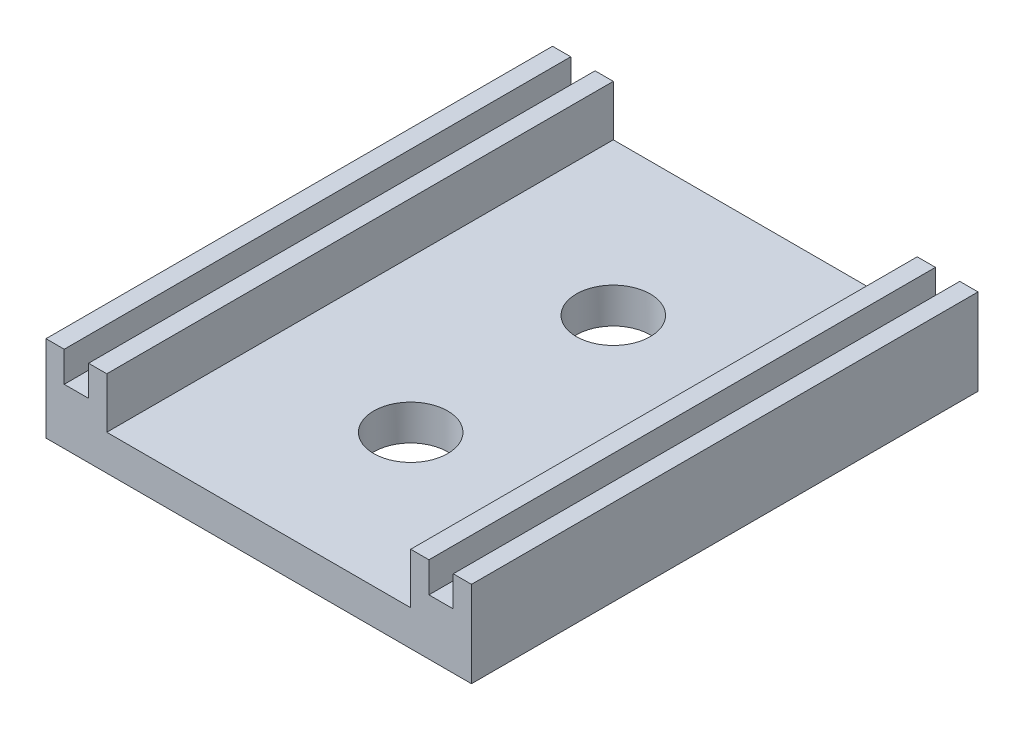
ISO-10303-21;
HEADER;
FILE_DESCRIPTION(('STEP AP214'),'2;1');
FILE_NAME('part.step','',(''),(''),'','','');
FILE_SCHEMA(('AUTOMOTIVE_DESIGN { 1 0 10303 214 1 1 1 1 }'));
ENDSEC;
DATA;
#1=APPLICATION_CONTEXT('core data for automotive mechanical design processes');
#2=APPLICATION_PROTOCOL_DEFINITION('international standard','automotive_design',2000,#1);
#3=PRODUCT_CONTEXT('',#1,'mechanical');
#4=PRODUCT('Part','Part','',(#3));
#5=PRODUCT_RELATED_PRODUCT_CATEGORY('part','',(#4));
#6=PRODUCT_DEFINITION_FORMATION('','',#4);
#7=PRODUCT_DEFINITION_CONTEXT('part definition',#1,'design');
#8=PRODUCT_DEFINITION('design','',#6,#7);
#9=PRODUCT_DEFINITION_SHAPE('','',#8);
#10=(LENGTH_UNIT() NAMED_UNIT(*) SI_UNIT(.MILLI.,.METRE.));
#11=(NAMED_UNIT(*) PLANE_ANGLE_UNIT() SI_UNIT($,.RADIAN.));
#12=(NAMED_UNIT(*) SI_UNIT($,.STERADIAN.) SOLID_ANGLE_UNIT());
#13=UNCERTAINTY_MEASURE_WITH_UNIT(LENGTH_MEASURE(1.E-05),#10,'distance_accuracy_value','');
#14=(GEOMETRIC_REPRESENTATION_CONTEXT(3) GLOBAL_UNCERTAINTY_ASSIGNED_CONTEXT((#13)) GLOBAL_UNIT_ASSIGNED_CONTEXT((#10,
#11,#12)) REPRESENTATION_CONTEXT('',''));
#15=CARTESIAN_POINT('',(0.,0.,0.));
#16=DIRECTION('',(0.,0.,1.));
#17=DIRECTION('',(1.,0.,0.));
#18=AXIS2_PLACEMENT_3D('',#15,#16,#17);
#19=CARTESIAN_POINT('',(0.,8.5,0.));
#20=DIRECTION('',(0.,1.,0.));
#21=DIRECTION('',(0.,0.,1.));
#22=AXIS2_PLACEMENT_3D('',#19,#20,#21);
#23=PLANE('',#22);
#24=DIRECTION('',(-1.,0.,0.));
#25=VECTOR('',#24,1.);
#26=CARTESIAN_POINT('',(-20.,8.5,-25.));
#27=LINE('',#26,#25);
#28=CARTESIAN_POINT('',(16.8,8.5,-25.));
#29=VERTEX_POINT('',#28);
#30=CARTESIAN_POINT('',(15.,8.5,-25.));
#31=VERTEX_POINT('',#30);
#32=EDGE_CURVE('E181',#29,#31,#27,.T.);
#33=ORIENTED_EDGE('',*,*,#32,.T.);
#34=DIRECTION('',(0.,0.,1.));
#35=VECTOR('',#34,1.);
#36=CARTESIAN_POINT('',(15.,8.5,25.));
#37=LINE('',#36,#35);
#38=CARTESIAN_POINT('',(15.,8.5,25.));
#39=VERTEX_POINT('',#38);
#40=EDGE_CURVE('E174',#31,#39,#37,.T.);
#41=ORIENTED_EDGE('',*,*,#40,.T.);
#42=DIRECTION('',(-1.,0.,0.));
#43=VECTOR('',#42,1.);
#44=CARTESIAN_POINT('',(20.,8.5,25.));
#45=LINE('',#44,#43);
#46=CARTESIAN_POINT('',(16.8,8.5,25.));
#47=VERTEX_POINT('',#46);
#48=EDGE_CURVE('E157',#47,#39,#45,.T.);
#49=ORIENTED_EDGE('',*,*,#48,.F.);
#50=DIRECTION('',(0.,0.,-1.));
#51=VECTOR('',#50,1.);
#52=CARTESIAN_POINT('',(16.8,8.5,25.));
#53=LINE('',#52,#51);
#54=EDGE_CURVE('E262',#47,#29,#53,.T.);
#55=ORIENTED_EDGE('',*,*,#54,.T.);
#56=EDGE_LOOP('',(#33,#41,#49,#55));
#57=FACE_BOUND('',#56,.T.);
#58=ADVANCED_FACE('F41',(#57),#23,.T.);
#59=CARTESIAN_POINT('',(-20.,3.5,-25.));
#60=DIRECTION('',(0.,0.,1.));
#61=DIRECTION('',(1.,0.,0.));
#62=AXIS2_PLACEMENT_3D('',#59,#60,#61);
#63=PLANE('',#62);
#64=DIRECTION('',(-1.,0.,0.));
#65=VECTOR('',#64,1.);
#66=CARTESIAN_POINT('',(-16.,3.5,-25.));
#67=LINE('',#66,#65);
#68=CARTESIAN_POINT('',(15.,3.5,-25.));
#69=VERTEX_POINT('',#68);
#70=CARTESIAN_POINT('',(-15.,3.5,-25.));
#71=VERTEX_POINT('',#70);
#72=EDGE_CURVE('E205',#69,#71,#67,.T.);
#73=ORIENTED_EDGE('',*,*,#72,.F.);
#74=DIRECTION('',(0.,1.,0.));
#75=VECTOR('',#74,1.);
#76=CARTESIAN_POINT('',(15.,8.5,-25.));
#77=LINE('',#76,#75);
#78=EDGE_CURVE('E183',#69,#31,#77,.T.);
#79=ORIENTED_EDGE('',*,*,#78,.T.);
#80=ORIENTED_EDGE('',*,*,#32,.F.);
#81=DIRECTION('',(0.,1.,0.));
#82=VECTOR('',#81,1.);
#83=CARTESIAN_POINT('',(16.8,5.5,-25.));
#84=LINE('',#83,#82);
#85=CARTESIAN_POINT('',(16.8,5.5,-25.));
#86=VERTEX_POINT('',#85);
#87=EDGE_CURVE('E58',#86,#29,#84,.T.);
#88=ORIENTED_EDGE('',*,*,#87,.F.);
#89=DIRECTION('',(1.,0.,0.));
#90=VECTOR('',#89,1.);
#91=CARTESIAN_POINT('',(19.2,5.5,-25.));
#92=LINE('',#91,#90);
#93=CARTESIAN_POINT('',(19.2,5.5,-25.));
#94=VERTEX_POINT('',#93);
#95=EDGE_CURVE('E261',#86,#94,#92,.T.);
#96=ORIENTED_EDGE('',*,*,#95,.T.);
#97=DIRECTION('',(0.,1.,0.));
#98=VECTOR('',#97,1.);
#99=CARTESIAN_POINT('',(19.2,5.5,-25.));
#100=LINE('',#99,#98);
#101=CARTESIAN_POINT('',(19.2,8.5,-25.));
#102=VERTEX_POINT('',#101);
#103=EDGE_CURVE('E272',#94,#102,#100,.T.);
#104=ORIENTED_EDGE('',*,*,#103,.T.);
#105=CARTESIAN_POINT('',(21.,8.5,-25.));
#106=VERTEX_POINT('',#105);
#107=EDGE_CURVE('E330',#106,#102,#27,.T.);
#108=ORIENTED_EDGE('',*,*,#107,.F.);
#109=DIRECTION('',(0.,-1.,0.));
#110=VECTOR('',#109,1.);
#111=CARTESIAN_POINT('',(21.,8.5,-25.));
#112=LINE('',#111,#110);
#113=CARTESIAN_POINT('',(21.,0.,-25.));
#114=VERTEX_POINT('',#113);
#115=EDGE_CURVE('E224',#106,#114,#112,.T.);
#116=ORIENTED_EDGE('',*,*,#115,.T.);
#117=DIRECTION('',(-1.,0.,0.));
#118=VECTOR('',#117,1.);
#119=CARTESIAN_POINT('',(-20.,0.,-25.));
#120=LINE('',#119,#118);
#121=CARTESIAN_POINT('',(-21.,0.,-25.));
#122=VERTEX_POINT('',#121);
#123=EDGE_CURVE('E333',#114,#122,#120,.T.);
#124=ORIENTED_EDGE('',*,*,#123,.T.);
#125=DIRECTION('',(0.,-1.,0.));
#126=VECTOR('',#125,1.);
#127=CARTESIAN_POINT('',(-21.,8.5,-25.));
#128=LINE('',#127,#126);
#129=CARTESIAN_POINT('',(-21.,8.5,-25.));
#130=VERTEX_POINT('',#129);
#131=EDGE_CURVE('E240',#130,#122,#128,.T.);
#132=ORIENTED_EDGE('',*,*,#131,.F.);
#133=CARTESIAN_POINT('',(-19.2,8.5,-25.));
#134=VERTEX_POINT('',#133);
#135=EDGE_CURVE('E329',#134,#130,#27,.T.);
#136=ORIENTED_EDGE('',*,*,#135,.F.);
#137=DIRECTION('',(0.,1.,0.));
#138=VECTOR('',#137,1.);
#139=CARTESIAN_POINT('',(-19.2,5.5,-25.));
#140=LINE('',#139,#138);
#141=CARTESIAN_POINT('',(-19.2,5.5,-25.));
#142=VERTEX_POINT('',#141);
#143=EDGE_CURVE('E312',#142,#134,#140,.T.);
#144=ORIENTED_EDGE('',*,*,#143,.F.);
#145=DIRECTION('',(-1.,0.,0.));
#146=VECTOR('',#145,1.);
#147=CARTESIAN_POINT('',(-19.2,5.5,-25.));
#148=LINE('',#147,#146);
#149=CARTESIAN_POINT('',(-16.8,5.5,-25.));
#150=VERTEX_POINT('',#149);
#151=EDGE_CURVE('E303',#150,#142,#148,.T.);
#152=ORIENTED_EDGE('',*,*,#151,.F.);
#153=DIRECTION('',(0.,1.,0.));
#154=VECTOR('',#153,1.);
#155=CARTESIAN_POINT('',(-16.8,5.5,-25.));
#156=LINE('',#155,#154);
#157=CARTESIAN_POINT('',(-16.8,8.5,-25.));
#158=VERTEX_POINT('',#157);
#159=EDGE_CURVE('E316',#150,#158,#156,.T.);
#160=ORIENTED_EDGE('',*,*,#159,.T.);
#161=CARTESIAN_POINT('',(-15.,8.5,-25.));
#162=VERTEX_POINT('',#161);
#163=EDGE_CURVE('E334',#162,#158,#27,.T.);
#164=ORIENTED_EDGE('',*,*,#163,.F.);
#165=DIRECTION('',(0.,1.,0.));
#166=VECTOR('',#165,1.);
#167=CARTESIAN_POINT('',(-15.,8.5,-25.));
#168=LINE('',#167,#166);
#169=EDGE_CURVE('E197',#71,#162,#168,.T.);
#170=ORIENTED_EDGE('',*,*,#169,.F.);
#171=EDGE_LOOP('',(#73,#79,#80,#88,#96,#104,#108,#116,#124,#132,#136,#144,#152,#160,#164,#170));
#172=FACE_BOUND('',#171,.T.);
#173=ADVANCED_FACE('F43',(#172),#63,.F.);
#174=CARTESIAN_POINT('',(-20.,3.5,25.));
#175=DIRECTION('',(0.,0.,-1.));
#176=DIRECTION('',(-1.,0.,0.));
#177=AXIS2_PLACEMENT_3D('',#174,#175,#176);
#178=PLANE('',#177);
#179=DIRECTION('',(1.,0.,0.));
#180=VECTOR('',#179,1.);
#181=CARTESIAN_POINT('',(-20.,3.5,25.));
#182=LINE('',#181,#180);
#183=CARTESIAN_POINT('',(-15.,3.5,25.));
#184=VERTEX_POINT('',#183);
#185=CARTESIAN_POINT('',(15.,3.5,25.));
#186=VERTEX_POINT('',#185);
#187=EDGE_CURVE('E11',#184,#186,#182,.T.);
#188=ORIENTED_EDGE('',*,*,#187,.F.);
#189=DIRECTION('',(0.,-1.,0.));
#190=VECTOR('',#189,1.);
#191=CARTESIAN_POINT('',(-15.,8.5,25.));
#192=LINE('',#191,#190);
#193=CARTESIAN_POINT('',(-15.,8.5,25.));
#194=VERTEX_POINT('',#193);
#195=EDGE_CURVE('E190',#194,#184,#192,.T.);
#196=ORIENTED_EDGE('',*,*,#195,.F.);
#197=DIRECTION('',(1.,0.,0.));
#198=VECTOR('',#197,1.);
#199=CARTESIAN_POINT('',(-20.,8.5,25.));
#200=LINE('',#199,#198);
#201=CARTESIAN_POINT('',(-16.8,8.5,25.));
#202=VERTEX_POINT('',#201);
#203=EDGE_CURVE('E315',#202,#194,#200,.T.);
#204=ORIENTED_EDGE('',*,*,#203,.F.);
#205=DIRECTION('',(0.,1.,0.));
#206=VECTOR('',#205,1.);
#207=CARTESIAN_POINT('',(-16.8,5.5,25.));
#208=LINE('',#207,#206);
#209=CARTESIAN_POINT('',(-16.8,5.5,25.));
#210=VERTEX_POINT('',#209);
#211=EDGE_CURVE('E66',#210,#202,#208,.T.);
#212=ORIENTED_EDGE('',*,*,#211,.F.);
#213=DIRECTION('',(1.,0.,0.));
#214=VECTOR('',#213,1.);
#215=CARTESIAN_POINT('',(-19.2,5.5,25.));
#216=LINE('',#215,#214);
#217=CARTESIAN_POINT('',(-19.2,5.5,25.));
#218=VERTEX_POINT('',#217);
#219=EDGE_CURVE('E294',#218,#210,#216,.T.);
#220=ORIENTED_EDGE('',*,*,#219,.F.);
#221=DIRECTION('',(0.,1.,0.));
#222=VECTOR('',#221,1.);
#223=CARTESIAN_POINT('',(-19.2,5.5,25.));
#224=LINE('',#223,#222);
#225=CARTESIAN_POINT('',(-19.2,8.5,25.));
#226=VERTEX_POINT('',#225);
#227=EDGE_CURVE('E307',#218,#226,#224,.T.);
#228=ORIENTED_EDGE('',*,*,#227,.T.);
#229=CARTESIAN_POINT('',(-21.,8.5,25.));
#230=VERTEX_POINT('',#229);
#231=EDGE_CURVE('E325',#230,#226,#200,.T.);
#232=ORIENTED_EDGE('',*,*,#231,.F.);
#233=DIRECTION('',(0.,1.,0.));
#234=VECTOR('',#233,1.);
#235=CARTESIAN_POINT('',(-21.,8.5,25.));
#236=LINE('',#235,#234);
#237=CARTESIAN_POINT('',(-21.,0.,25.));
#238=VERTEX_POINT('',#237);
#239=EDGE_CURVE('E248',#238,#230,#236,.T.);
#240=ORIENTED_EDGE('',*,*,#239,.F.);
#241=DIRECTION('',(1.,0.,0.));
#242=VECTOR('',#241,1.);
#243=CARTESIAN_POINT('',(-20.,0.,25.));
#244=LINE('',#243,#242);
#245=CARTESIAN_POINT('',(21.,0.,25.));
#246=VERTEX_POINT('',#245);
#247=EDGE_CURVE('E45',#238,#246,#244,.T.);
#248=ORIENTED_EDGE('',*,*,#247,.T.);
#249=DIRECTION('',(0.,1.,0.));
#250=VECTOR('',#249,1.);
#251=CARTESIAN_POINT('',(21.,8.5,25.));
#252=LINE('',#251,#250);
#253=CARTESIAN_POINT('',(21.,8.5,25.));
#254=VERTEX_POINT('',#253);
#255=EDGE_CURVE('E232',#246,#254,#252,.T.);
#256=ORIENTED_EDGE('',*,*,#255,.T.);
#257=CARTESIAN_POINT('',(19.2,8.5,25.));
#258=VERTEX_POINT('',#257);
#259=EDGE_CURVE('E168',#254,#258,#45,.T.);
#260=ORIENTED_EDGE('',*,*,#259,.T.);
#261=DIRECTION('',(0.,1.,0.));
#262=VECTOR('',#261,1.);
#263=CARTESIAN_POINT('',(19.2,5.5,25.));
#264=LINE('',#263,#262);
#265=CARTESIAN_POINT('',(19.2,5.5,25.));
#266=VERTEX_POINT('',#265);
#267=EDGE_CURVE('E169',#266,#258,#264,.T.);
#268=ORIENTED_EDGE('',*,*,#267,.F.);
#269=DIRECTION('',(-1.,0.,0.));
#270=VECTOR('',#269,1.);
#271=CARTESIAN_POINT('',(19.2,5.5,25.));
#272=LINE('',#271,#270);
#273=CARTESIAN_POINT('',(16.8,5.5,25.));
#274=VERTEX_POINT('',#273);
#275=EDGE_CURVE('E269',#266,#274,#272,.T.);
#276=ORIENTED_EDGE('',*,*,#275,.T.);
#277=DIRECTION('',(0.,1.,0.));
#278=VECTOR('',#277,1.);
#279=CARTESIAN_POINT('',(16.8,5.5,25.));
#280=LINE('',#279,#278);
#281=EDGE_CURVE('E164',#274,#47,#280,.T.);
#282=ORIENTED_EDGE('',*,*,#281,.T.);
#283=ORIENTED_EDGE('',*,*,#48,.T.);
#284=DIRECTION('',(0.,-1.,0.));
#285=VECTOR('',#284,1.);
#286=CARTESIAN_POINT('',(15.,8.5,25.));
#287=LINE('',#286,#285);
#288=EDGE_CURVE('E161',#39,#186,#287,.T.);
#289=ORIENTED_EDGE('',*,*,#288,.T.);
#290=EDGE_LOOP('',(#188,#196,#204,#212,#220,#228,#232,#240,#248,#256,#260,#268,#276,#282,#283,#289));
#291=FACE_BOUND('',#290,.T.);
#292=ADVANCED_FACE('F160',(#291),#178,.F.);
#293=ORIENTED_EDGE('',*,*,#107,.T.);
#294=DIRECTION('',(0.,0.,1.));
#295=VECTOR('',#294,1.);
#296=CARTESIAN_POINT('',(19.2,8.5,25.));
#297=LINE('',#296,#295);
#298=EDGE_CURVE('E256',#102,#258,#297,.T.);
#299=ORIENTED_EDGE('',*,*,#298,.T.);
#300=ORIENTED_EDGE('',*,*,#259,.F.);
#301=DIRECTION('',(0.,0.,-1.));
#302=VECTOR('',#301,1.);
#303=CARTESIAN_POINT('',(21.,8.5,-25.));
#304=LINE('',#303,#302);
#305=EDGE_CURVE('E228',#254,#106,#304,.T.);
#306=ORIENTED_EDGE('',*,*,#305,.T.);
#307=EDGE_LOOP('',(#293,#299,#300,#306));
#308=FACE_BOUND('',#307,.T.);
#309=ADVANCED_FACE('F351',(#308),#23,.T.);
#310=ORIENTED_EDGE('',*,*,#203,.T.);
#311=DIRECTION('',(0.,0.,1.));
#312=VECTOR('',#311,1.);
#313=CARTESIAN_POINT('',(-15.,8.5,25.));
#314=LINE('',#313,#312);
#315=EDGE_CURVE('E201',#162,#194,#314,.T.);
#316=ORIENTED_EDGE('',*,*,#315,.F.);
#317=ORIENTED_EDGE('',*,*,#163,.T.);
#318=DIRECTION('',(0.,0.,-1.));
#319=VECTOR('',#318,1.);
#320=CARTESIAN_POINT('',(-16.8,8.5,25.));
#321=LINE('',#320,#319);
#322=EDGE_CURVE('E295',#202,#158,#321,.T.);
#323=ORIENTED_EDGE('',*,*,#322,.F.);
#324=EDGE_LOOP('',(#310,#316,#317,#323));
#325=FACE_BOUND('',#324,.T.);
#326=ADVANCED_FACE('F383',(#325),#23,.T.);
#327=DIRECTION('',(0.,0.,1.));
#328=VECTOR('',#327,1.);
#329=CARTESIAN_POINT('',(-19.2,8.5,25.));
#330=LINE('',#329,#328);
#331=EDGE_CURVE('E289',#134,#226,#330,.T.);
#332=ORIENTED_EDGE('',*,*,#331,.F.);
#333=ORIENTED_EDGE('',*,*,#135,.T.);
#334=DIRECTION('',(0.,0.,-1.));
#335=VECTOR('',#334,1.);
#336=CARTESIAN_POINT('',(-21.,8.5,-25.));
#337=LINE('',#336,#335);
#338=EDGE_CURVE('E252',#230,#130,#337,.T.);
#339=ORIENTED_EDGE('',*,*,#338,.F.);
#340=ORIENTED_EDGE('',*,*,#231,.T.);
#341=EDGE_LOOP('',(#332,#333,#339,#340));
#342=FACE_BOUND('',#341,.T.);
#343=ADVANCED_FACE('F367',(#342),#23,.T.);
#344=CARTESIAN_POINT('',(0.,3.5,0.));
#345=DIRECTION('',(0.,-1.,0.));
#346=DIRECTION('',(0.,0.,-1.));
#347=AXIS2_PLACEMENT_3D('',#344,#345,#346);
#348=PLANE('',#347);
#349=CARTESIAN_POINT('',(0.,3.5,10.));
#350=DIRECTION('',(0.,-1.,0.));
#351=DIRECTION('',(0.,0.,-1.));
#352=AXIS2_PLACEMENT_3D('',#349,#350,#351);
#353=CIRCLE('',#352,3.65);
#354=CARTESIAN_POINT('',(0.,3.5,6.35));
#355=VERTEX_POINT('',#354);
#356=EDGE_CURVE('E220',#355,#355,#353,.T.);
#357=ORIENTED_EDGE('',*,*,#356,.T.);
#358=EDGE_LOOP('',(#357));
#359=FACE_BOUND('',#358,.T.);
#360=CARTESIAN_POINT('',(0.,3.5,-10.));
#361=DIRECTION('',(0.,-1.,0.));
#362=DIRECTION('',(0.,0.,-1.));
#363=AXIS2_PLACEMENT_3D('',#360,#361,#362);
#364=CIRCLE('',#363,3.65);
#365=CARTESIAN_POINT('',(0.,3.5,-13.65));
#366=VERTEX_POINT('',#365);
#367=EDGE_CURVE('E213',#366,#366,#364,.T.);
#368=ORIENTED_EDGE('',*,*,#367,.T.);
#369=EDGE_LOOP('',(#368));
#370=FACE_BOUND('',#369,.T.);
#371=ORIENTED_EDGE('',*,*,#187,.T.);
#372=DIRECTION('',(0.,0.,-1.));
#373=VECTOR('',#372,1.);
#374=CARTESIAN_POINT('',(15.,3.5,25.));
#375=LINE('',#374,#373);
#376=EDGE_CURVE('E177',#186,#69,#375,.T.);
#377=ORIENTED_EDGE('',*,*,#376,.T.);
#378=ORIENTED_EDGE('',*,*,#72,.T.);
#379=DIRECTION('',(0.,0.,-1.));
#380=VECTOR('',#379,1.);
#381=CARTESIAN_POINT('',(-15.,3.5,25.));
#382=LINE('',#381,#380);
#383=EDGE_CURVE('E193',#184,#71,#382,.T.);
#384=ORIENTED_EDGE('',*,*,#383,.F.);
#385=EDGE_LOOP('',(#371,#377,#378,#384));
#386=FACE_BOUND('',#385,.T.);
#387=ADVANCED_FACE('F396',(#359,#370,#386),#348,.F.);
#388=CARTESIAN_POINT('',(0.,0.,0.));
#389=DIRECTION('',(0.,-1.,0.));
#390=DIRECTION('',(0.,0.,-1.));
#391=AXIS2_PLACEMENT_3D('',#388,#389,#390);
#392=PLANE('',#391);
#393=CARTESIAN_POINT('',(0.,0.,10.));
#394=DIRECTION('',(0.,1.,0.));
#395=DIRECTION('',(0.,0.,1.));
#396=AXIS2_PLACEMENT_3D('',#393,#394,#395);
#397=CIRCLE('',#396,3.65);
#398=CARTESIAN_POINT('',(0.,0.,13.65));
#399=VERTEX_POINT('',#398);
#400=EDGE_CURVE('E209',#399,#399,#397,.T.);
#401=ORIENTED_EDGE('',*,*,#400,.T.);
#402=EDGE_LOOP('',(#401));
#403=FACE_BOUND('',#402,.T.);
#404=CARTESIAN_POINT('',(0.,0.,-10.));
#405=DIRECTION('',(0.,1.,0.));
#406=DIRECTION('',(0.,0.,1.));
#407=AXIS2_PLACEMENT_3D('',#404,#405,#406);
#408=CIRCLE('',#407,3.65);
#409=CARTESIAN_POINT('',(0.,0.,-6.35));
#410=VERTEX_POINT('',#409);
#411=EDGE_CURVE('E208',#410,#410,#408,.T.);
#412=ORIENTED_EDGE('',*,*,#411,.T.);
#413=EDGE_LOOP('',(#412));
#414=FACE_BOUND('',#413,.T.);
#415=ORIENTED_EDGE('',*,*,#123,.F.);
#416=DIRECTION('',(0.,0.,1.));
#417=VECTOR('',#416,1.);
#418=CARTESIAN_POINT('',(21.,0.,-25.));
#419=LINE('',#418,#417);
#420=EDGE_CURVE('E236',#114,#246,#419,.T.);
#421=ORIENTED_EDGE('',*,*,#420,.T.);
#422=ORIENTED_EDGE('',*,*,#247,.F.);
#423=DIRECTION('',(0.,0.,1.));
#424=VECTOR('',#423,1.);
#425=CARTESIAN_POINT('',(-21.,0.,-25.));
#426=LINE('',#425,#424);
#427=EDGE_CURVE('E244',#122,#238,#426,.T.);
#428=ORIENTED_EDGE('',*,*,#427,.F.);
#429=EDGE_LOOP('',(#415,#421,#422,#428));
#430=FACE_BOUND('',#429,.T.);
#431=ADVANCED_FACE('F348',(#403,#414,#430),#392,.T.);
#432=CARTESIAN_POINT('',(-19.2,5.5,25.));
#433=DIRECTION('',(-1.,0.,0.));
#434=DIRECTION('',(0.,0.,1.));
#435=AXIS2_PLACEMENT_3D('',#432,#433,#434);
#436=PLANE('',#435);
#437=ORIENTED_EDGE('',*,*,#331,.T.);
#438=ORIENTED_EDGE('',*,*,#227,.F.);
#439=DIRECTION('',(0.,0.,1.));
#440=VECTOR('',#439,1.);
#441=CARTESIAN_POINT('',(-19.2,5.5,25.));
#442=LINE('',#441,#440);
#443=EDGE_CURVE('E290',#142,#218,#442,.T.);
#444=ORIENTED_EDGE('',*,*,#443,.F.);
#445=ORIENTED_EDGE('',*,*,#143,.T.);
#446=EDGE_LOOP('',(#437,#438,#444,#445));
#447=FACE_BOUND('',#446,.T.);
#448=ADVANCED_FACE('F404',(#447),#436,.F.);
#449=CARTESIAN_POINT('',(-16.8,5.5,25.));
#450=DIRECTION('',(1.,0.,0.));
#451=DIRECTION('',(0.,0.,-1.));
#452=AXIS2_PLACEMENT_3D('',#449,#450,#451);
#453=PLANE('',#452);
#454=ORIENTED_EDGE('',*,*,#322,.T.);
#455=ORIENTED_EDGE('',*,*,#159,.F.);
#456=DIRECTION('',(0.,0.,-1.));
#457=VECTOR('',#456,1.);
#458=CARTESIAN_POINT('',(-16.8,5.5,25.));
#459=LINE('',#458,#457);
#460=EDGE_CURVE('E299',#210,#150,#459,.T.);
#461=ORIENTED_EDGE('',*,*,#460,.F.);
#462=ORIENTED_EDGE('',*,*,#211,.T.);
#463=EDGE_LOOP('',(#454,#455,#461,#462));
#464=FACE_BOUND('',#463,.T.);
#465=ADVANCED_FACE('F419',(#464),#453,.F.);
#466=CARTESIAN_POINT('',(0.,5.5,0.));
#467=DIRECTION('',(0.,-1.,0.));
#468=DIRECTION('',(0.,0.,-1.));
#469=AXIS2_PLACEMENT_3D('',#466,#467,#468);
#470=PLANE('',#469);
#471=ORIENTED_EDGE('',*,*,#443,.T.);
#472=ORIENTED_EDGE('',*,*,#219,.T.);
#473=ORIENTED_EDGE('',*,*,#460,.T.);
#474=ORIENTED_EDGE('',*,*,#151,.T.);
#475=EDGE_LOOP('',(#471,#472,#473,#474));
#476=FACE_BOUND('',#475,.T.);
#477=ADVANCED_FACE('F422',(#476),#470,.F.);
#478=CARTESIAN_POINT('',(19.2,5.5,25.));
#479=DIRECTION('',(-1.,0.,0.));
#480=DIRECTION('',(0.,0.,1.));
#481=AXIS2_PLACEMENT_3D('',#478,#479,#480);
#482=PLANE('',#481);
#483=ORIENTED_EDGE('',*,*,#298,.F.);
#484=ORIENTED_EDGE('',*,*,#103,.F.);
#485=DIRECTION('',(0.,0.,1.));
#486=VECTOR('',#485,1.);
#487=CARTESIAN_POINT('',(19.2,5.5,25.));
#488=LINE('',#487,#486);
#489=EDGE_CURVE('E257',#94,#266,#488,.T.);
#490=ORIENTED_EDGE('',*,*,#489,.T.);
#491=ORIENTED_EDGE('',*,*,#267,.T.);
#492=EDGE_LOOP('',(#483,#484,#490,#491));
#493=FACE_BOUND('',#492,.T.);
#494=ADVANCED_FACE('F354',(#493),#482,.T.);
#495=CARTESIAN_POINT('',(16.8,5.5,25.));
#496=DIRECTION('',(1.,0.,0.));
#497=DIRECTION('',(0.,0.,-1.));
#498=AXIS2_PLACEMENT_3D('',#495,#496,#497);
#499=PLANE('',#498);
#500=ORIENTED_EDGE('',*,*,#54,.F.);
#501=ORIENTED_EDGE('',*,*,#281,.F.);
#502=DIRECTION('',(0.,0.,-1.));
#503=VECTOR('',#502,1.);
#504=CARTESIAN_POINT('',(16.8,5.5,25.));
#505=LINE('',#504,#503);
#506=EDGE_CURVE('E266',#274,#86,#505,.T.);
#507=ORIENTED_EDGE('',*,*,#506,.T.);
#508=ORIENTED_EDGE('',*,*,#87,.T.);
#509=EDGE_LOOP('',(#500,#501,#507,#508));
#510=FACE_BOUND('',#509,.T.);
#511=ADVANCED_FACE('F379',(#510),#499,.T.);
#512=CARTESIAN_POINT('',(0.,5.5,0.));
#513=DIRECTION('',(0.,-1.,0.));
#514=DIRECTION('',(0.,0.,-1.));
#515=AXIS2_PLACEMENT_3D('',#512,#513,#514);
#516=PLANE('',#515);
#517=ORIENTED_EDGE('',*,*,#489,.F.);
#518=ORIENTED_EDGE('',*,*,#95,.F.);
#519=ORIENTED_EDGE('',*,*,#506,.F.);
#520=ORIENTED_EDGE('',*,*,#275,.F.);
#521=EDGE_LOOP('',(#517,#518,#519,#520));
#522=FACE_BOUND('',#521,.T.);
#523=ADVANCED_FACE('F358',(#522),#516,.F.);
#524=CARTESIAN_POINT('',(-21.,0.,0.));
#525=DIRECTION('',(-1.,0.,0.));
#526=DIRECTION('',(0.,0.,1.));
#527=AXIS2_PLACEMENT_3D('',#524,#525,#526);
#528=PLANE('',#527);
#529=ORIENTED_EDGE('',*,*,#131,.T.);
#530=ORIENTED_EDGE('',*,*,#427,.T.);
#531=ORIENTED_EDGE('',*,*,#239,.T.);
#532=ORIENTED_EDGE('',*,*,#338,.T.);
#533=EDGE_LOOP('',(#529,#530,#531,#532));
#534=FACE_BOUND('',#533,.T.);
#535=ADVANCED_FACE('F370',(#534),#528,.T.);
#536=CARTESIAN_POINT('',(21.,0.,0.));
#537=DIRECTION('',(1.,0.,0.));
#538=DIRECTION('',(0.,0.,1.));
#539=AXIS2_PLACEMENT_3D('',#536,#537,#538);
#540=PLANE('',#539);
#541=ORIENTED_EDGE('',*,*,#115,.F.);
#542=ORIENTED_EDGE('',*,*,#305,.F.);
#543=ORIENTED_EDGE('',*,*,#255,.F.);
#544=ORIENTED_EDGE('',*,*,#420,.F.);
#545=EDGE_LOOP('',(#541,#542,#543,#544));
#546=FACE_BOUND('',#545,.T.);
#547=ADVANCED_FACE('F347',(#546),#540,.T.);
#548=CARTESIAN_POINT('',(0.,0.,-10.));
#549=DIRECTION('',(0.,1.,0.));
#550=DIRECTION('',(0.,0.,1.));
#551=AXIS2_PLACEMENT_3D('',#548,#549,#550);
#552=CYLINDRICAL_SURFACE('',#551,3.65);
#553=ORIENTED_EDGE('',*,*,#411,.F.);
#554=EDGE_LOOP('',(#553));
#555=FACE_BOUND('',#554,.T.);
#556=ORIENTED_EDGE('',*,*,#367,.F.);
#557=EDGE_LOOP('',(#556));
#558=FACE_BOUND('',#557,.T.);
#559=ADVANCED_FACE('F377',(#555,#558),#552,.F.);
#560=CARTESIAN_POINT('',(0.,0.,10.));
#561=DIRECTION('',(0.,1.,0.));
#562=DIRECTION('',(0.,0.,1.));
#563=AXIS2_PLACEMENT_3D('',#560,#561,#562);
#564=CYLINDRICAL_SURFACE('',#563,3.65);
#565=ORIENTED_EDGE('',*,*,#400,.F.);
#566=EDGE_LOOP('',(#565));
#567=FACE_BOUND('',#566,.T.);
#568=ORIENTED_EDGE('',*,*,#356,.F.);
#569=EDGE_LOOP('',(#568));
#570=FACE_BOUND('',#569,.T.);
#571=ADVANCED_FACE('F484',(#567,#570),#564,.F.);
#572=CARTESIAN_POINT('',(-15.,0.,0.));
#573=DIRECTION('',(1.,0.,0.));
#574=DIRECTION('',(0.,0.,-1.));
#575=AXIS2_PLACEMENT_3D('',#572,#573,#574);
#576=PLANE('',#575);
#577=ORIENTED_EDGE('',*,*,#195,.T.);
#578=ORIENTED_EDGE('',*,*,#383,.T.);
#579=ORIENTED_EDGE('',*,*,#169,.T.);
#580=ORIENTED_EDGE('',*,*,#315,.T.);
#581=EDGE_LOOP('',(#577,#578,#579,#580));
#582=FACE_BOUND('',#581,.T.);
#583=ADVANCED_FACE('F415',(#582),#576,.T.);
#584=CARTESIAN_POINT('',(15.,0.,0.));
#585=DIRECTION('',(-1.,0.,0.));
#586=DIRECTION('',(0.,0.,-1.));
#587=AXIS2_PLACEMENT_3D('',#584,#585,#586);
#588=PLANE('',#587);
#589=ORIENTED_EDGE('',*,*,#288,.F.);
#590=ORIENTED_EDGE('',*,*,#40,.F.);
#591=ORIENTED_EDGE('',*,*,#78,.F.);
#592=ORIENTED_EDGE('',*,*,#376,.F.);
#593=EDGE_LOOP('',(#589,#590,#591,#592));
#594=FACE_BOUND('',#593,.T.);
#595=ADVANCED_FACE('F173',(#594),#588,.T.);
#596=CLOSED_SHELL('',(#58,#173,#292,#309,#326,#343,#387,#431,#448,#465,#477,#494,#511,#523,#535,
#547,#559,#571,#583,#595));
#597=MANIFOLD_SOLID_BREP('B2',#596);
#598=ADVANCED_BREP_SHAPE_REPRESENTATION('',(#18,#597),#14);
#599=SHAPE_DEFINITION_REPRESENTATION(#9,#598);
ENDSEC;
END-ISO-10303-21;
